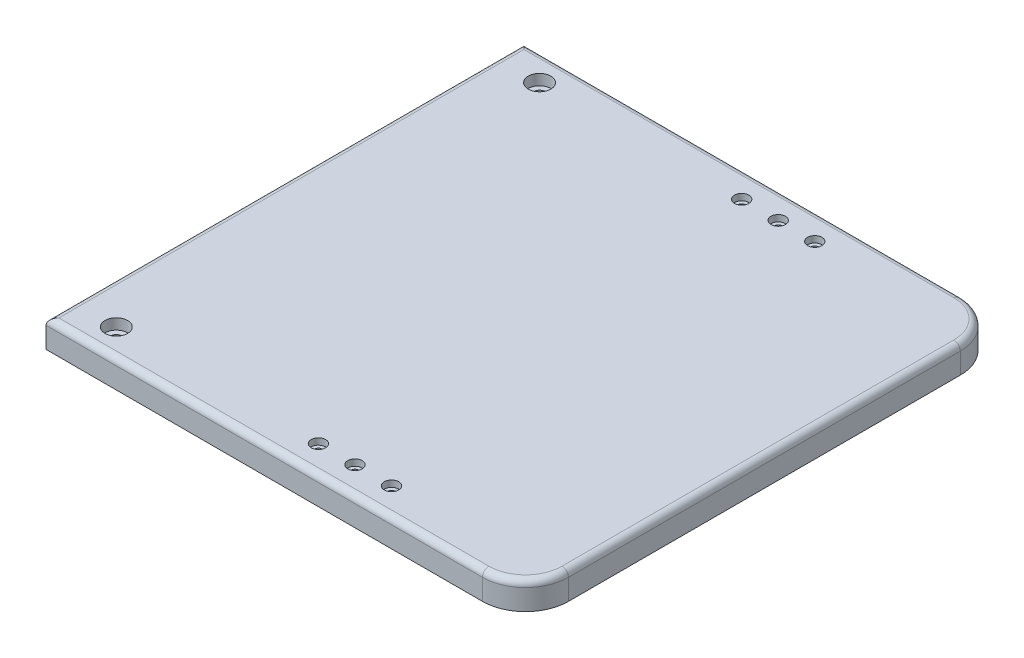
ISO-10303-21;
HEADER;
FILE_DESCRIPTION(('STEP AP214'),'2;1');
FILE_NAME('part.step','',(''),(''),'','','');
FILE_SCHEMA(('AUTOMOTIVE_DESIGN { 1 0 10303 214 1 1 1 1 }'));
ENDSEC;
DATA;
#1=APPLICATION_CONTEXT('core data for automotive mechanical design processes');
#2=APPLICATION_PROTOCOL_DEFINITION('international standard','automotive_design',2000,#1);
#3=PRODUCT_CONTEXT('',#1,'mechanical');
#4=PRODUCT('Part','Part','',(#3));
#5=PRODUCT_RELATED_PRODUCT_CATEGORY('part','',(#4));
#6=PRODUCT_DEFINITION_FORMATION('','',#4);
#7=PRODUCT_DEFINITION_CONTEXT('part definition',#1,'design');
#8=PRODUCT_DEFINITION('design','',#6,#7);
#9=PRODUCT_DEFINITION_SHAPE('','',#8);
#10=(LENGTH_UNIT() NAMED_UNIT(*) SI_UNIT(.MILLI.,.METRE.));
#11=(NAMED_UNIT(*) PLANE_ANGLE_UNIT() SI_UNIT($,.RADIAN.));
#12=(NAMED_UNIT(*) SI_UNIT($,.STERADIAN.) SOLID_ANGLE_UNIT());
#13=UNCERTAINTY_MEASURE_WITH_UNIT(LENGTH_MEASURE(1.E-05),#10,'distance_accuracy_value','');
#14=(GEOMETRIC_REPRESENTATION_CONTEXT(3) GLOBAL_UNCERTAINTY_ASSIGNED_CONTEXT((#13)) GLOBAL_UNIT_ASSIGNED_CONTEXT((#10,
#11,#12)) REPRESENTATION_CONTEXT('',''));
#15=CARTESIAN_POINT('',(0.,0.,0.));
#16=DIRECTION('',(0.,0.,1.));
#17=DIRECTION('',(1.,0.,0.));
#18=AXIS2_PLACEMENT_3D('',#15,#16,#17);
#19=CARTESIAN_POINT('',(-91.5,12.7,98.425));
#20=DIRECTION('',(0.,1.,0.));
#21=DIRECTION('',(0.,0.,1.));
#22=AXIS2_PLACEMENT_3D('',#19,#20,#21);
#23=CYLINDRICAL_SURFACE('',#22,2.75);
#24=CARTESIAN_POINT('',(-91.5,7.7,98.425));
#25=DIRECTION('',(0.,1.,0.));
#26=DIRECTION('',(0.,0.,1.));
#27=AXIS2_PLACEMENT_3D('',#24,#25,#26);
#28=CIRCLE('',#27,2.75);
#29=CARTESIAN_POINT('',(-91.5,7.7,101.175));
#30=VERTEX_POINT('',#29);
#31=EDGE_CURVE('E266',#30,#30,#28,.T.);
#32=ORIENTED_EDGE('',*,*,#31,.T.);
#33=EDGE_LOOP('',(#32));
#34=FACE_BOUND('',#33,.T.);
#35=CARTESIAN_POINT('',(-91.5,2.,98.425));
#36=DIRECTION('',(0.,-1.,0.));
#37=DIRECTION('',(0.,0.,-1.));
#38=AXIS2_PLACEMENT_3D('',#35,#36,#37);
#39=CIRCLE('',#38,2.75);
#40=CARTESIAN_POINT('',(-91.5,2.,95.675));
#41=VERTEX_POINT('',#40);
#42=EDGE_CURVE('E47',#41,#41,#39,.F.);
#43=ORIENTED_EDGE('',*,*,#42,.F.);
#44=EDGE_LOOP('',(#43));
#45=FACE_BOUND('',#44,.T.);
#46=ADVANCED_FACE('F43',(#34,#45),#23,.F.);
#47=CARTESIAN_POINT('',(111.5,12.7,-111.125));
#48=DIRECTION('',(-1.,0.,0.));
#49=DIRECTION('',(0.,0.,1.));
#50=AXIS2_PLACEMENT_3D('',#47,#48,#49);
#51=PLANE('',#50);
#52=DIRECTION('',(0.,-1.,0.));
#53=VECTOR('',#52,1.);
#54=CARTESIAN_POINT('',(111.5,12.7,-91.125));
#55=LINE('',#54,#53);
#56=CARTESIAN_POINT('',(111.5,0.,-91.125));
#57=VERTEX_POINT('',#56);
#58=CARTESIAN_POINT('',(111.5,9.7,-91.125));
#59=VERTEX_POINT('',#58);
#60=EDGE_CURVE('E159',#57,#59,#55,.F.);
#61=ORIENTED_EDGE('',*,*,#60,.T.);
#62=DIRECTION('',(0.,0.,-1.));
#63=VECTOR('',#62,1.);
#64=CARTESIAN_POINT('',(111.5,9.7,91.125));
#65=LINE('',#64,#63);
#66=CARTESIAN_POINT('',(111.5,9.7,91.125));
#67=VERTEX_POINT('',#66);
#68=EDGE_CURVE('E11',#59,#67,#65,.F.);
#69=ORIENTED_EDGE('',*,*,#68,.T.);
#70=DIRECTION('',(0.,-1.,0.));
#71=VECTOR('',#70,1.);
#72=CARTESIAN_POINT('',(111.5,12.7,91.125));
#73=LINE('',#72,#71);
#74=CARTESIAN_POINT('',(111.5,0.,91.125));
#75=VERTEX_POINT('',#74);
#76=EDGE_CURVE('E156',#67,#75,#73,.T.);
#77=ORIENTED_EDGE('',*,*,#76,.T.);
#78=DIRECTION('',(0.,0.,-1.));
#79=VECTOR('',#78,1.);
#80=CARTESIAN_POINT('',(111.5,0.,-111.125));
#81=LINE('',#80,#79);
#82=EDGE_CURVE('E135',#75,#57,#81,.T.);
#83=ORIENTED_EDGE('',*,*,#82,.T.);
#84=EDGE_LOOP('',(#61,#69,#77,#83));
#85=FACE_BOUND('',#84,.T.);
#86=ADVANCED_FACE('F368',(#85),#51,.F.);
#87=CARTESIAN_POINT('',(-111.5,12.7,-111.125));
#88=DIRECTION('',(0.,0.,1.));
#89=DIRECTION('',(1.,0.,0.));
#90=AXIS2_PLACEMENT_3D('',#87,#88,#89);
#91=PLANE('',#90);
#92=DIRECTION('',(0.,-1.,0.));
#93=VECTOR('',#92,1.);
#94=CARTESIAN_POINT('',(-111.5,12.7,-111.125));
#95=LINE('',#94,#93);
#96=CARTESIAN_POINT('',(-111.5,9.7,-111.125));
#97=VERTEX_POINT('',#96);
#98=CARTESIAN_POINT('',(-111.5,0.,-111.125));
#99=VERTEX_POINT('',#98);
#100=EDGE_CURVE('E116',#97,#99,#95,.T.);
#101=ORIENTED_EDGE('',*,*,#100,.F.);
#102=DIRECTION('',(-1.,0.,0.));
#103=VECTOR('',#102,1.);
#104=CARTESIAN_POINT('',(91.4999999999999,9.7,-111.125));
#105=LINE('',#104,#103);
#106=CARTESIAN_POINT('',(91.5,9.7,-111.125));
#107=VERTEX_POINT('',#106);
#108=EDGE_CURVE('E68',#97,#107,#105,.F.);
#109=ORIENTED_EDGE('',*,*,#108,.T.);
#110=DIRECTION('',(0.,-1.,0.));
#111=VECTOR('',#110,1.);
#112=CARTESIAN_POINT('',(91.5,12.7,-111.125));
#113=LINE('',#112,#111);
#114=CARTESIAN_POINT('',(91.4999999999999,0.,-111.125));
#115=VERTEX_POINT('',#114);
#116=EDGE_CURVE('E126',#107,#115,#113,.T.);
#117=ORIENTED_EDGE('',*,*,#116,.T.);
#118=DIRECTION('',(-1.,0.,0.));
#119=VECTOR('',#118,1.);
#120=CARTESIAN_POINT('',(-111.5,0.,-111.125));
#121=LINE('',#120,#119);
#122=EDGE_CURVE('E130',#115,#99,#121,.T.);
#123=ORIENTED_EDGE('',*,*,#122,.T.);
#124=EDGE_LOOP('',(#101,#109,#117,#123));
#125=FACE_BOUND('',#124,.T.);
#126=ADVANCED_FACE('F131',(#125),#91,.F.);
#127=CARTESIAN_POINT('',(-111.5,12.7,-111.125));
#128=DIRECTION('',(1.,0.,0.));
#129=DIRECTION('',(0.,0.,-1.));
#130=AXIS2_PLACEMENT_3D('',#127,#128,#129);
#131=PLANE('',#130);
#132=DIRECTION('',(0.,-1.,0.));
#133=VECTOR('',#132,1.);
#134=CARTESIAN_POINT('',(-111.5,12.7,111.125));
#135=LINE('',#134,#133);
#136=CARTESIAN_POINT('',(-111.5,9.7,111.125));
#137=VERTEX_POINT('',#136);
#138=CARTESIAN_POINT('',(-111.5,0.,111.125));
#139=VERTEX_POINT('',#138);
#140=EDGE_CURVE('E127',#137,#139,#135,.T.);
#141=ORIENTED_EDGE('',*,*,#140,.F.);
#142=DIRECTION('',(0.,0.,1.));
#143=VECTOR('',#142,1.);
#144=CARTESIAN_POINT('',(-111.5,9.7,-111.125));
#145=LINE('',#144,#143);
#146=EDGE_CURVE('E124',#137,#97,#145,.F.);
#147=ORIENTED_EDGE('',*,*,#146,.T.);
#148=ORIENTED_EDGE('',*,*,#100,.T.);
#149=DIRECTION('',(0.,0.,1.));
#150=VECTOR('',#149,1.);
#151=CARTESIAN_POINT('',(-111.5,0.,-111.125));
#152=LINE('',#151,#150);
#153=EDGE_CURVE('E121',#99,#139,#152,.T.);
#154=ORIENTED_EDGE('',*,*,#153,.T.);
#155=EDGE_LOOP('',(#141,#147,#148,#154));
#156=FACE_BOUND('',#155,.T.);
#157=ADVANCED_FACE('F119',(#156),#131,.F.);
#158=CARTESIAN_POINT('',(-111.5,12.7,111.125));
#159=DIRECTION('',(0.,0.,-1.));
#160=DIRECTION('',(-1.,0.,0.));
#161=AXIS2_PLACEMENT_3D('',#158,#159,#160);
#162=PLANE('',#161);
#163=DIRECTION('',(0.,-1.,0.));
#164=VECTOR('',#163,1.);
#165=CARTESIAN_POINT('',(91.5,12.7,111.125));
#166=LINE('',#165,#164);
#167=CARTESIAN_POINT('',(91.5,0.,111.125));
#168=VERTEX_POINT('',#167);
#169=CARTESIAN_POINT('',(91.5,9.7,111.125));
#170=VERTEX_POINT('',#169);
#171=EDGE_CURVE('E162',#168,#170,#166,.F.);
#172=ORIENTED_EDGE('',*,*,#171,.T.);
#173=DIRECTION('',(1.,0.,0.));
#174=VECTOR('',#173,1.);
#175=CARTESIAN_POINT('',(-111.5,9.7,111.125));
#176=LINE('',#175,#174);
#177=EDGE_CURVE('E189',#170,#137,#176,.F.);
#178=ORIENTED_EDGE('',*,*,#177,.T.);
#179=ORIENTED_EDGE('',*,*,#140,.T.);
#180=DIRECTION('',(1.,0.,0.));
#181=VECTOR('',#180,1.);
#182=CARTESIAN_POINT('',(-111.5,0.,111.125));
#183=LINE('',#182,#181);
#184=EDGE_CURVE('E139',#139,#168,#183,.T.);
#185=ORIENTED_EDGE('',*,*,#184,.T.);
#186=EDGE_LOOP('',(#172,#178,#179,#185));
#187=FACE_BOUND('',#186,.T.);
#188=ADVANCED_FACE('F399',(#187),#162,.F.);
#189=CARTESIAN_POINT('',(0.,12.7,0.));
#190=DIRECTION('',(0.,1.,0.));
#191=DIRECTION('',(0.,0.,1.));
#192=AXIS2_PLACEMENT_3D('',#189,#190,#191);
#193=PLANE('',#192);
#194=CARTESIAN_POINT('',(-91.5,12.7,-98.425));
#195=DIRECTION('',(0.,1.,0.));
#196=DIRECTION('',(0.,0.,1.));
#197=AXIS2_PLACEMENT_3D('',#194,#195,#196);
#198=CIRCLE('',#197,5.25);
#199=CARTESIAN_POINT('',(-91.5,12.7,-93.175));
#200=VERTEX_POINT('',#199);
#201=EDGE_CURVE('E229',#200,#200,#198,.T.);
#202=ORIENTED_EDGE('',*,*,#201,.F.);
#203=EDGE_LOOP('',(#202));
#204=FACE_BOUND('',#203,.T.);
#205=CARTESIAN_POINT('',(-91.5,12.7,98.425));
#206=DIRECTION('',(0.,1.,0.));
#207=DIRECTION('',(0.,0.,1.));
#208=AXIS2_PLACEMENT_3D('',#205,#206,#207);
#209=CIRCLE('',#208,5.25);
#210=CARTESIAN_POINT('',(-91.5,12.7,103.675));
#211=VERTEX_POINT('',#210);
#212=EDGE_CURVE('E258',#211,#211,#209,.T.);
#213=ORIENTED_EDGE('',*,*,#212,.F.);
#214=EDGE_LOOP('',(#213));
#215=FACE_BOUND('',#214,.T.);
#216=CARTESIAN_POINT('',(36.5,12.7,98.425));
#217=DIRECTION('',(0.,1.,0.));
#218=DIRECTION('',(0.,0.,1.));
#219=AXIS2_PLACEMENT_3D('',#216,#217,#218);
#220=CIRCLE('',#219,3.35);
#221=CARTESIAN_POINT('',(36.5,12.7,101.775));
#222=VERTEX_POINT('',#221);
#223=EDGE_CURVE('E270',#222,#222,#220,.T.);
#224=ORIENTED_EDGE('',*,*,#223,.F.);
#225=EDGE_LOOP('',(#224));
#226=FACE_BOUND('',#225,.T.);
#227=CARTESIAN_POINT('',(36.5,12.7,-98.425));
#228=DIRECTION('',(0.,1.,0.));
#229=DIRECTION('',(0.,0.,1.));
#230=AXIS2_PLACEMENT_3D('',#227,#228,#229);
#231=CIRCLE('',#230,3.35);
#232=CARTESIAN_POINT('',(36.5,12.7,-95.075));
#233=VERTEX_POINT('',#232);
#234=EDGE_CURVE('E286',#233,#233,#231,.T.);
#235=ORIENTED_EDGE('',*,*,#234,.F.);
#236=EDGE_LOOP('',(#235));
#237=FACE_BOUND('',#236,.T.);
#238=CARTESIAN_POINT('',(19.5,12.7,98.425));
#239=DIRECTION('',(0.,1.,0.));
#240=DIRECTION('',(0.,0.,1.));
#241=AXIS2_PLACEMENT_3D('',#238,#239,#240);
#242=CIRCLE('',#241,3.35);
#243=CARTESIAN_POINT('',(19.5,12.7,101.775));
#244=VERTEX_POINT('',#243);
#245=EDGE_CURVE('E302',#244,#244,#242,.T.);
#246=ORIENTED_EDGE('',*,*,#245,.F.);
#247=EDGE_LOOP('',(#246));
#248=FACE_BOUND('',#247,.T.);
#249=CARTESIAN_POINT('',(19.5,12.7,-98.425));
#250=DIRECTION('',(0.,1.,0.));
#251=DIRECTION('',(0.,0.,1.));
#252=AXIS2_PLACEMENT_3D('',#249,#250,#251);
#253=CIRCLE('',#252,3.35);
#254=CARTESIAN_POINT('',(19.5,12.7,-95.075));
#255=VERTEX_POINT('',#254);
#256=EDGE_CURVE('E318',#255,#255,#253,.T.);
#257=ORIENTED_EDGE('',*,*,#256,.F.);
#258=EDGE_LOOP('',(#257));
#259=FACE_BOUND('',#258,.T.);
#260=CARTESIAN_POINT('',(2.49999999999999,12.7,98.425));
#261=DIRECTION('',(0.,1.,0.));
#262=DIRECTION('',(0.,0.,1.));
#263=AXIS2_PLACEMENT_3D('',#260,#261,#262);
#264=CIRCLE('',#263,3.35);
#265=CARTESIAN_POINT('',(2.49999999999999,12.7,101.775));
#266=VERTEX_POINT('',#265);
#267=EDGE_CURVE('E334',#266,#266,#264,.T.);
#268=ORIENTED_EDGE('',*,*,#267,.F.);
#269=EDGE_LOOP('',(#268));
#270=FACE_BOUND('',#269,.T.);
#271=CARTESIAN_POINT('',(2.49999999999996,12.7,-98.425));
#272=DIRECTION('',(0.,1.,0.));
#273=DIRECTION('',(0.,0.,1.));
#274=AXIS2_PLACEMENT_3D('',#271,#272,#273);
#275=CIRCLE('',#274,3.35);
#276=CARTESIAN_POINT('',(2.49999999999996,12.7,-95.075));
#277=VERTEX_POINT('',#276);
#278=EDGE_CURVE('E350',#277,#277,#275,.T.);
#279=ORIENTED_EDGE('',*,*,#278,.F.);
#280=EDGE_LOOP('',(#279));
#281=FACE_BOUND('',#280,.T.);
#282=DIRECTION('',(1.,0.,0.));
#283=VECTOR('',#282,1.);
#284=CARTESIAN_POINT('',(91.5,12.7,108.125));
#285=LINE('',#284,#283);
#286=CARTESIAN_POINT('',(-108.5,12.7,108.125));
#287=VERTEX_POINT('',#286);
#288=CARTESIAN_POINT('',(91.5,12.7,108.125));
#289=VERTEX_POINT('',#288);
#290=EDGE_CURVE('E178',#287,#289,#285,.T.);
#291=ORIENTED_EDGE('',*,*,#290,.T.);
#292=CARTESIAN_POINT('',(91.5,12.7,91.125));
#293=DIRECTION('',(0.,1.,0.));
#294=DIRECTION('',(0.,0.,1.));
#295=AXIS2_PLACEMENT_3D('',#292,#293,#294);
#296=CIRCLE('',#295,17.);
#297=CARTESIAN_POINT('',(108.5,12.7,91.125));
#298=VERTEX_POINT('',#297);
#299=EDGE_CURVE('E181',#289,#298,#296,.T.);
#300=ORIENTED_EDGE('',*,*,#299,.T.);
#301=DIRECTION('',(0.,0.,-1.));
#302=VECTOR('',#301,1.);
#303=CARTESIAN_POINT('',(108.5,12.7,-91.125));
#304=LINE('',#303,#302);
#305=CARTESIAN_POINT('',(108.5,12.7,-91.125));
#306=VERTEX_POINT('',#305);
#307=EDGE_CURVE('E166',#298,#306,#304,.T.);
#308=ORIENTED_EDGE('',*,*,#307,.T.);
#309=CARTESIAN_POINT('',(91.5,12.7,-91.125));
#310=DIRECTION('',(0.,1.,0.));
#311=DIRECTION('',(0.,0.,1.));
#312=AXIS2_PLACEMENT_3D('',#309,#310,#311);
#313=CIRCLE('',#312,17.);
#314=CARTESIAN_POINT('',(91.5,12.7,-108.125));
#315=VERTEX_POINT('',#314);
#316=EDGE_CURVE('E169',#306,#315,#313,.T.);
#317=ORIENTED_EDGE('',*,*,#316,.T.);
#318=DIRECTION('',(-1.,0.,0.));
#319=VECTOR('',#318,1.);
#320=CARTESIAN_POINT('',(-111.5,12.7,-108.125));
#321=LINE('',#320,#319);
#322=CARTESIAN_POINT('',(-108.5,12.7,-108.125));
#323=VERTEX_POINT('',#322);
#324=EDGE_CURVE('E172',#315,#323,#321,.T.);
#325=ORIENTED_EDGE('',*,*,#324,.T.);
#326=DIRECTION('',(0.,0.,1.));
#327=VECTOR('',#326,1.);
#328=CARTESIAN_POINT('',(-108.5,12.7,111.125));
#329=LINE('',#328,#327);
#330=EDGE_CURVE('E175',#323,#287,#329,.T.);
#331=ORIENTED_EDGE('',*,*,#330,.T.);
#332=EDGE_LOOP('',(#291,#300,#308,#317,#325,#331));
#333=FACE_BOUND('',#332,.T.);
#334=ADVANCED_FACE('F404',(#204,#215,#226,#237,#248,#259,#270,#281,#333),#193,.T.);
#335=CARTESIAN_POINT('',(0.,0.,0.));
#336=DIRECTION('',(0.,1.,0.));
#337=DIRECTION('',(0.,0.,1.));
#338=AXIS2_PLACEMENT_3D('',#335,#336,#337);
#339=PLANE('',#338);
#340=CARTESIAN_POINT('',(-91.5,0.,98.425));
#341=DIRECTION('',(0.,-1.,0.));
#342=DIRECTION('',(0.,0.,-1.));
#343=AXIS2_PLACEMENT_3D('',#340,#341,#342);
#344=CIRCLE('',#343,6.5);
#345=CARTESIAN_POINT('',(-91.5,0.,91.925));
#346=VERTEX_POINT('',#345);
#347=EDGE_CURVE('E231',#346,#346,#344,.T.);
#348=ORIENTED_EDGE('',*,*,#347,.F.);
#349=EDGE_LOOP('',(#348));
#350=FACE_BOUND('',#349,.T.);
#351=CARTESIAN_POINT('',(-91.4999999999999,0.,-98.4250000000001));
#352=DIRECTION('',(0.,-1.,0.));
#353=DIRECTION('',(0.,0.,1.));
#354=AXIS2_PLACEMENT_3D('',#351,#352,#353);
#355=CIRCLE('',#354,6.5);
#356=CARTESIAN_POINT('',(-91.4999999999999,0.,-91.9250000000001));
#357=VERTEX_POINT('',#356);
#358=EDGE_CURVE('E237',#357,#357,#355,.T.);
#359=ORIENTED_EDGE('',*,*,#358,.F.);
#360=EDGE_LOOP('',(#359));
#361=FACE_BOUND('',#360,.T.);
#362=CARTESIAN_POINT('',(36.5,0.,98.425));
#363=DIRECTION('',(0.,1.,0.));
#364=DIRECTION('',(0.,0.,1.));
#365=AXIS2_PLACEMENT_3D('',#362,#363,#364);
#366=CIRCLE('',#365,1.7);
#367=CARTESIAN_POINT('',(36.5,0.,100.125));
#368=VERTEX_POINT('',#367);
#369=EDGE_CURVE('E282',#368,#368,#366,.T.);
#370=ORIENTED_EDGE('',*,*,#369,.T.);
#371=EDGE_LOOP('',(#370));
#372=FACE_BOUND('',#371,.T.);
#373=CARTESIAN_POINT('',(36.5,0.,-98.425));
#374=DIRECTION('',(0.,1.,0.));
#375=DIRECTION('',(0.,0.,1.));
#376=AXIS2_PLACEMENT_3D('',#373,#374,#375);
#377=CIRCLE('',#376,1.7);
#378=CARTESIAN_POINT('',(36.5,0.,-96.725));
#379=VERTEX_POINT('',#378);
#380=EDGE_CURVE('E298',#379,#379,#377,.T.);
#381=ORIENTED_EDGE('',*,*,#380,.T.);
#382=EDGE_LOOP('',(#381));
#383=FACE_BOUND('',#382,.T.);
#384=CARTESIAN_POINT('',(19.5,0.,98.425));
#385=DIRECTION('',(0.,1.,0.));
#386=DIRECTION('',(0.,0.,1.));
#387=AXIS2_PLACEMENT_3D('',#384,#385,#386);
#388=CIRCLE('',#387,1.7);
#389=CARTESIAN_POINT('',(19.5,0.,100.125));
#390=VERTEX_POINT('',#389);
#391=EDGE_CURVE('E314',#390,#390,#388,.T.);
#392=ORIENTED_EDGE('',*,*,#391,.T.);
#393=EDGE_LOOP('',(#392));
#394=FACE_BOUND('',#393,.T.);
#395=CARTESIAN_POINT('',(19.5,0.,-98.425));
#396=DIRECTION('',(0.,1.,0.));
#397=DIRECTION('',(0.,0.,1.));
#398=AXIS2_PLACEMENT_3D('',#395,#396,#397);
#399=CIRCLE('',#398,1.7);
#400=CARTESIAN_POINT('',(19.5,0.,-96.725));
#401=VERTEX_POINT('',#400);
#402=EDGE_CURVE('E330',#401,#401,#399,.T.);
#403=ORIENTED_EDGE('',*,*,#402,.T.);
#404=EDGE_LOOP('',(#403));
#405=FACE_BOUND('',#404,.T.);
#406=CARTESIAN_POINT('',(2.49999999999999,0.,98.425));
#407=DIRECTION('',(0.,1.,0.));
#408=DIRECTION('',(0.,0.,1.));
#409=AXIS2_PLACEMENT_3D('',#406,#407,#408);
#410=CIRCLE('',#409,1.7);
#411=CARTESIAN_POINT('',(2.49999999999999,0.,100.125));
#412=VERTEX_POINT('',#411);
#413=EDGE_CURVE('E346',#412,#412,#410,.T.);
#414=ORIENTED_EDGE('',*,*,#413,.T.);
#415=EDGE_LOOP('',(#414));
#416=FACE_BOUND('',#415,.T.);
#417=CARTESIAN_POINT('',(2.49999999999996,0.,-98.425));
#418=DIRECTION('',(0.,1.,0.));
#419=DIRECTION('',(0.,0.,1.));
#420=AXIS2_PLACEMENT_3D('',#417,#418,#419);
#421=CIRCLE('',#420,1.7);
#422=CARTESIAN_POINT('',(2.49999999999996,0.,-96.725));
#423=VERTEX_POINT('',#422);
#424=EDGE_CURVE('E202',#423,#423,#421,.T.);
#425=ORIENTED_EDGE('',*,*,#424,.T.);
#426=EDGE_LOOP('',(#425));
#427=FACE_BOUND('',#426,.T.);
#428=ORIENTED_EDGE('',*,*,#122,.F.);
#429=CARTESIAN_POINT('',(91.5,0.,-91.125));
#430=DIRECTION('',(0.,1.,0.));
#431=DIRECTION('',(0.,0.,1.));
#432=AXIS2_PLACEMENT_3D('',#429,#430,#431);
#433=CIRCLE('',#432,20.);
#434=EDGE_CURVE('E153',#115,#57,#433,.F.);
#435=ORIENTED_EDGE('',*,*,#434,.T.);
#436=ORIENTED_EDGE('',*,*,#82,.F.);
#437=CARTESIAN_POINT('',(91.5,0.,91.125));
#438=DIRECTION('',(0.,1.,0.));
#439=DIRECTION('',(0.,0.,1.));
#440=AXIS2_PLACEMENT_3D('',#437,#438,#439);
#441=CIRCLE('',#440,20.);
#442=EDGE_CURVE('E150',#75,#168,#441,.F.);
#443=ORIENTED_EDGE('',*,*,#442,.T.);
#444=ORIENTED_EDGE('',*,*,#184,.F.);
#445=ORIENTED_EDGE('',*,*,#153,.F.);
#446=EDGE_LOOP('',(#428,#435,#436,#443,#444,#445));
#447=FACE_BOUND('',#446,.T.);
#448=ADVANCED_FACE('F137',(#350,#361,#372,#383,#394,#405,#416,#427,#447),#339,.F.);
#449=CARTESIAN_POINT('',(91.5,12.7,-91.125));
#450=DIRECTION('',(0.,-1.,0.));
#451=DIRECTION('',(0.,0.,-1.));
#452=AXIS2_PLACEMENT_3D('',#449,#450,#451);
#453=CYLINDRICAL_SURFACE('',#452,20.);
#454=ORIENTED_EDGE('',*,*,#116,.F.);
#455=CARTESIAN_POINT('',(91.5,9.7,-91.125));
#456=DIRECTION('',(0.,1.,0.));
#457=DIRECTION('',(0.,0.,1.));
#458=AXIS2_PLACEMENT_3D('',#455,#456,#457);
#459=CIRCLE('',#458,20.);
#460=EDGE_CURVE('E53',#107,#59,#459,.F.);
#461=ORIENTED_EDGE('',*,*,#460,.T.);
#462=ORIENTED_EDGE('',*,*,#60,.F.);
#463=ORIENTED_EDGE('',*,*,#434,.F.);
#464=EDGE_LOOP('',(#454,#461,#462,#463));
#465=FACE_BOUND('',#464,.T.);
#466=ADVANCED_FACE('F372',(#465),#453,.T.);
#467=CARTESIAN_POINT('',(91.5,12.7,91.125));
#468=DIRECTION('',(0.,-1.,0.));
#469=DIRECTION('',(0.,0.,-1.));
#470=AXIS2_PLACEMENT_3D('',#467,#468,#469);
#471=CYLINDRICAL_SURFACE('',#470,20.);
#472=ORIENTED_EDGE('',*,*,#76,.F.);
#473=CARTESIAN_POINT('',(91.5,9.7,91.125));
#474=DIRECTION('',(0.,1.,0.));
#475=DIRECTION('',(0.,0.,1.));
#476=AXIS2_PLACEMENT_3D('',#473,#474,#475);
#477=CIRCLE('',#476,20.);
#478=EDGE_CURVE('E185',#67,#170,#477,.F.);
#479=ORIENTED_EDGE('',*,*,#478,.T.);
#480=ORIENTED_EDGE('',*,*,#171,.F.);
#481=ORIENTED_EDGE('',*,*,#442,.F.);
#482=EDGE_LOOP('',(#472,#479,#480,#481));
#483=FACE_BOUND('',#482,.T.);
#484=ADVANCED_FACE('F387',(#483),#471,.T.);
#485=CARTESIAN_POINT('',(0.,9.7,-108.125));
#486=DIRECTION('',(1.,0.,0.));
#487=DIRECTION('',(0.,0.,-1.));
#488=AXIS2_PLACEMENT_3D('',#485,#486,#487);
#489=CYLINDRICAL_SURFACE('',#488,3.);
#490=CARTESIAN_POINT('',(91.5,9.7,-108.125));
#491=DIRECTION('',(1.,0.,0.));
#492=DIRECTION('',(0.,0.,-1.));
#493=AXIS2_PLACEMENT_3D('',#490,#491,#492);
#494=CIRCLE('',#493,3.);
#495=EDGE_CURVE('E213',#107,#315,#494,.T.);
#496=ORIENTED_EDGE('',*,*,#495,.F.);
#497=ORIENTED_EDGE('',*,*,#108,.F.);
#498=CARTESIAN_POINT('',(-108.5,9.7,-108.125));
#499=DIRECTION('',(0.707106781186547,0.,-0.707106781186548));
#500=DIRECTION('',(0.707106781186548,0.,0.707106781186547));
#501=AXIS2_PLACEMENT_3D('',#498,#499,#500);
#502=ELLIPSE('',#501,4.24264068711929,3.);
#503=EDGE_CURVE('E217',#323,#97,#502,.F.);
#504=ORIENTED_EDGE('',*,*,#503,.F.);
#505=ORIENTED_EDGE('',*,*,#324,.F.);
#506=EDGE_LOOP('',(#496,#497,#504,#505));
#507=FACE_BOUND('',#506,.T.);
#508=ADVANCED_FACE('F45',(#507),#489,.T.);
#509=CARTESIAN_POINT('',(-108.5,9.7,0.));
#510=DIRECTION('',(0.,0.,-1.));
#511=DIRECTION('',(-1.,0.,0.));
#512=AXIS2_PLACEMENT_3D('',#509,#510,#511);
#513=CYLINDRICAL_SURFACE('',#512,3.);
#514=ORIENTED_EDGE('',*,*,#503,.T.);
#515=ORIENTED_EDGE('',*,*,#146,.F.);
#516=CARTESIAN_POINT('',(-108.5,9.7,108.125));
#517=DIRECTION('',(-0.707106781186548,0.,-0.707106781186547));
#518=DIRECTION('',(0.707106781186547,0.,-0.707106781186548));
#519=AXIS2_PLACEMENT_3D('',#516,#517,#518);
#520=ELLIPSE('',#519,4.24264068711928,3.);
#521=EDGE_CURVE('E209',#287,#137,#520,.F.);
#522=ORIENTED_EDGE('',*,*,#521,.F.);
#523=ORIENTED_EDGE('',*,*,#330,.F.);
#524=EDGE_LOOP('',(#514,#515,#522,#523));
#525=FACE_BOUND('',#524,.T.);
#526=ADVANCED_FACE('F401',(#525),#513,.T.);
#527=CARTESIAN_POINT('',(91.5,9.7,-91.125));
#528=DIRECTION('',(0.,1.,0.));
#529=DIRECTION('',(0.,0.,1.));
#530=AXIS2_PLACEMENT_3D('',#527,#528,#529);
#531=TOROIDAL_SURFACE('',#530,17.,3.);
#532=ORIENTED_EDGE('',*,*,#495,.T.);
#533=ORIENTED_EDGE('',*,*,#316,.F.);
#534=CARTESIAN_POINT('',(108.5,9.7,-91.125));
#535=DIRECTION('',(0.,0.,1.));
#536=DIRECTION('',(1.,0.,0.));
#537=AXIS2_PLACEMENT_3D('',#534,#535,#536);
#538=CIRCLE('',#537,3.);
#539=EDGE_CURVE('E205',#59,#306,#538,.T.);
#540=ORIENTED_EDGE('',*,*,#539,.F.);
#541=ORIENTED_EDGE('',*,*,#460,.F.);
#542=EDGE_LOOP('',(#532,#533,#540,#541));
#543=FACE_BOUND('',#542,.T.);
#544=ADVANCED_FACE('F379',(#543),#531,.T.);
#545=CARTESIAN_POINT('',(0.,9.7,108.125));
#546=DIRECTION('',(-1.,0.,0.));
#547=DIRECTION('',(0.,0.,1.));
#548=AXIS2_PLACEMENT_3D('',#545,#546,#547);
#549=CYLINDRICAL_SURFACE('',#548,3.);
#550=ORIENTED_EDGE('',*,*,#521,.T.);
#551=ORIENTED_EDGE('',*,*,#177,.F.);
#552=CARTESIAN_POINT('',(91.5,9.7,108.125));
#553=DIRECTION('',(1.,0.,0.));
#554=DIRECTION('',(0.,0.,-1.));
#555=AXIS2_PLACEMENT_3D('',#552,#553,#554);
#556=CIRCLE('',#555,3.);
#557=EDGE_CURVE('E201',#289,#170,#556,.T.);
#558=ORIENTED_EDGE('',*,*,#557,.F.);
#559=ORIENTED_EDGE('',*,*,#290,.F.);
#560=EDGE_LOOP('',(#550,#551,#558,#559));
#561=FACE_BOUND('',#560,.T.);
#562=ADVANCED_FACE('F396',(#561),#549,.T.);
#563=CARTESIAN_POINT('',(108.5,9.7,0.));
#564=DIRECTION('',(0.,0.,1.));
#565=DIRECTION('',(1.,0.,0.));
#566=AXIS2_PLACEMENT_3D('',#563,#564,#565);
#567=CYLINDRICAL_SURFACE('',#566,3.);
#568=ORIENTED_EDGE('',*,*,#539,.T.);
#569=ORIENTED_EDGE('',*,*,#307,.F.);
#570=CARTESIAN_POINT('',(108.5,9.7,91.125));
#571=DIRECTION('',(0.,0.,1.));
#572=DIRECTION('',(1.,0.,0.));
#573=AXIS2_PLACEMENT_3D('',#570,#571,#572);
#574=CIRCLE('',#573,3.);
#575=EDGE_CURVE('E198',#67,#298,#574,.T.);
#576=ORIENTED_EDGE('',*,*,#575,.F.);
#577=ORIENTED_EDGE('',*,*,#68,.F.);
#578=EDGE_LOOP('',(#568,#569,#576,#577));
#579=FACE_BOUND('',#578,.T.);
#580=ADVANCED_FACE('F384',(#579),#567,.T.);
#581=CARTESIAN_POINT('',(91.5,9.7,91.125));
#582=DIRECTION('',(0.,1.,0.));
#583=DIRECTION('',(0.,0.,1.));
#584=AXIS2_PLACEMENT_3D('',#581,#582,#583);
#585=TOROIDAL_SURFACE('',#584,17.,3.);
#586=ORIENTED_EDGE('',*,*,#557,.T.);
#587=ORIENTED_EDGE('',*,*,#478,.F.);
#588=ORIENTED_EDGE('',*,*,#575,.T.);
#589=ORIENTED_EDGE('',*,*,#299,.F.);
#590=EDGE_LOOP('',(#586,#587,#588,#589));
#591=FACE_BOUND('',#590,.T.);
#592=ADVANCED_FACE('F390',(#591),#585,.T.);
#593=CARTESIAN_POINT('',(2.49999999999996,12.7,-98.425));
#594=DIRECTION('',(0.,1.,0.));
#595=DIRECTION('',(0.,0.,1.));
#596=AXIS2_PLACEMENT_3D('',#593,#594,#595);
#597=CYLINDRICAL_SURFACE('',#596,1.7);
#598=ORIENTED_EDGE('',*,*,#424,.F.);
#599=EDGE_LOOP('',(#598));
#600=FACE_BOUND('',#599,.T.);
#601=CARTESIAN_POINT('',(2.49999999999996,9.7,-98.425));
#602=DIRECTION('',(0.,1.,0.));
#603=DIRECTION('',(0.,0.,1.));
#604=AXIS2_PLACEMENT_3D('',#601,#602,#603);
#605=CIRCLE('',#604,1.7);
#606=CARTESIAN_POINT('',(2.49999999999996,9.7,-96.725));
#607=VERTEX_POINT('',#606);
#608=EDGE_CURVE('E358',#607,#607,#605,.T.);
#609=ORIENTED_EDGE('',*,*,#608,.T.);
#610=EDGE_LOOP('',(#609));
#611=FACE_BOUND('',#610,.T.);
#612=ADVANCED_FACE('F496',(#600,#611),#597,.F.);
#613=CARTESIAN_POINT('',(4.19999999999996,9.7,-98.425));
#614=DIRECTION('',(0.,-1.,0.));
#615=DIRECTION('',(0.,0.,-1.));
#616=AXIS2_PLACEMENT_3D('',#613,#614,#615);
#617=PLANE('',#616);
#618=ORIENTED_EDGE('',*,*,#608,.F.);
#619=EDGE_LOOP('',(#618));
#620=FACE_BOUND('',#619,.T.);
#621=CARTESIAN_POINT('',(2.49999999999996,9.7,-98.425));
#622=DIRECTION('',(0.,1.,0.));
#623=DIRECTION('',(0.,0.,1.));
#624=AXIS2_PLACEMENT_3D('',#621,#622,#623);
#625=CIRCLE('',#624,3.35);
#626=CARTESIAN_POINT('',(2.49999999999996,9.7,-95.075));
#627=VERTEX_POINT('',#626);
#628=EDGE_CURVE('E354',#627,#627,#625,.T.);
#629=ORIENTED_EDGE('',*,*,#628,.T.);
#630=EDGE_LOOP('',(#629));
#631=FACE_BOUND('',#630,.T.);
#632=ADVANCED_FACE('F493',(#620,#631),#617,.F.);
#633=CARTESIAN_POINT('',(2.49999999999996,12.7,-98.425));
#634=DIRECTION('',(0.,1.,0.));
#635=DIRECTION('',(0.,0.,1.));
#636=AXIS2_PLACEMENT_3D('',#633,#634,#635);
#637=CYLINDRICAL_SURFACE('',#636,3.35);
#638=ORIENTED_EDGE('',*,*,#628,.F.);
#639=EDGE_LOOP('',(#638));
#640=FACE_BOUND('',#639,.T.);
#641=ORIENTED_EDGE('',*,*,#278,.T.);
#642=EDGE_LOOP('',(#641));
#643=FACE_BOUND('',#642,.T.);
#644=ADVANCED_FACE('F489',(#640,#643),#637,.F.);
#645=CARTESIAN_POINT('',(2.49999999999999,12.7,98.425));
#646=DIRECTION('',(0.,1.,0.));
#647=DIRECTION('',(0.,0.,1.));
#648=AXIS2_PLACEMENT_3D('',#645,#646,#647);
#649=CYLINDRICAL_SURFACE('',#648,1.7);
#650=ORIENTED_EDGE('',*,*,#413,.F.);
#651=EDGE_LOOP('',(#650));
#652=FACE_BOUND('',#651,.T.);
#653=CARTESIAN_POINT('',(2.49999999999999,9.7,98.425));
#654=DIRECTION('',(0.,1.,0.));
#655=DIRECTION('',(0.,0.,1.));
#656=AXIS2_PLACEMENT_3D('',#653,#654,#655);
#657=CIRCLE('',#656,1.7);
#658=CARTESIAN_POINT('',(2.49999999999999,9.7,100.125));
#659=VERTEX_POINT('',#658);
#660=EDGE_CURVE('E342',#659,#659,#657,.T.);
#661=ORIENTED_EDGE('',*,*,#660,.T.);
#662=EDGE_LOOP('',(#661));
#663=FACE_BOUND('',#662,.T.);
#664=ADVANCED_FACE('F485',(#652,#663),#649,.F.);
#665=CARTESIAN_POINT('',(4.19999999999999,9.7,98.425));
#666=DIRECTION('',(0.,-1.,0.));
#667=DIRECTION('',(0.,0.,-1.));
#668=AXIS2_PLACEMENT_3D('',#665,#666,#667);
#669=PLANE('',#668);
#670=ORIENTED_EDGE('',*,*,#660,.F.);
#671=EDGE_LOOP('',(#670));
#672=FACE_BOUND('',#671,.T.);
#673=CARTESIAN_POINT('',(2.49999999999999,9.7,98.425));
#674=DIRECTION('',(0.,1.,0.));
#675=DIRECTION('',(0.,0.,1.));
#676=AXIS2_PLACEMENT_3D('',#673,#674,#675);
#677=CIRCLE('',#676,3.35);
#678=CARTESIAN_POINT('',(2.49999999999999,9.7,101.775));
#679=VERTEX_POINT('',#678);
#680=EDGE_CURVE('E338',#679,#679,#677,.T.);
#681=ORIENTED_EDGE('',*,*,#680,.T.);
#682=EDGE_LOOP('',(#681));
#683=FACE_BOUND('',#682,.T.);
#684=ADVANCED_FACE('F481',(#672,#683),#669,.F.);
#685=CARTESIAN_POINT('',(2.49999999999999,12.7,98.425));
#686=DIRECTION('',(0.,1.,0.));
#687=DIRECTION('',(0.,0.,1.));
#688=AXIS2_PLACEMENT_3D('',#685,#686,#687);
#689=CYLINDRICAL_SURFACE('',#688,3.35);
#690=ORIENTED_EDGE('',*,*,#680,.F.);
#691=EDGE_LOOP('',(#690));
#692=FACE_BOUND('',#691,.T.);
#693=ORIENTED_EDGE('',*,*,#267,.T.);
#694=EDGE_LOOP('',(#693));
#695=FACE_BOUND('',#694,.T.);
#696=ADVANCED_FACE('F477',(#692,#695),#689,.F.);
#697=CARTESIAN_POINT('',(19.5,12.7,-98.425));
#698=DIRECTION('',(0.,1.,0.));
#699=DIRECTION('',(0.,0.,1.));
#700=AXIS2_PLACEMENT_3D('',#697,#698,#699);
#701=CYLINDRICAL_SURFACE('',#700,1.7);
#702=ORIENTED_EDGE('',*,*,#402,.F.);
#703=EDGE_LOOP('',(#702));
#704=FACE_BOUND('',#703,.T.);
#705=CARTESIAN_POINT('',(19.5,9.7,-98.425));
#706=DIRECTION('',(0.,1.,0.));
#707=DIRECTION('',(0.,0.,1.));
#708=AXIS2_PLACEMENT_3D('',#705,#706,#707);
#709=CIRCLE('',#708,1.7);
#710=CARTESIAN_POINT('',(19.5,9.7,-96.725));
#711=VERTEX_POINT('',#710);
#712=EDGE_CURVE('E326',#711,#711,#709,.T.);
#713=ORIENTED_EDGE('',*,*,#712,.T.);
#714=EDGE_LOOP('',(#713));
#715=FACE_BOUND('',#714,.T.);
#716=ADVANCED_FACE('F473',(#704,#715),#701,.F.);
#717=CARTESIAN_POINT('',(21.2,9.7,-98.425));
#718=DIRECTION('',(0.,-1.,0.));
#719=DIRECTION('',(0.,0.,-1.));
#720=AXIS2_PLACEMENT_3D('',#717,#718,#719);
#721=PLANE('',#720);
#722=ORIENTED_EDGE('',*,*,#712,.F.);
#723=EDGE_LOOP('',(#722));
#724=FACE_BOUND('',#723,.T.);
#725=CARTESIAN_POINT('',(19.5,9.7,-98.425));
#726=DIRECTION('',(0.,1.,0.));
#727=DIRECTION('',(0.,0.,1.));
#728=AXIS2_PLACEMENT_3D('',#725,#726,#727);
#729=CIRCLE('',#728,3.35);
#730=CARTESIAN_POINT('',(19.5,9.7,-95.075));
#731=VERTEX_POINT('',#730);
#732=EDGE_CURVE('E322',#731,#731,#729,.T.);
#733=ORIENTED_EDGE('',*,*,#732,.T.);
#734=EDGE_LOOP('',(#733));
#735=FACE_BOUND('',#734,.T.);
#736=ADVANCED_FACE('F469',(#724,#735),#721,.F.);
#737=CARTESIAN_POINT('',(19.5,12.7,-98.425));
#738=DIRECTION('',(0.,1.,0.));
#739=DIRECTION('',(0.,0.,1.));
#740=AXIS2_PLACEMENT_3D('',#737,#738,#739);
#741=CYLINDRICAL_SURFACE('',#740,3.35);
#742=ORIENTED_EDGE('',*,*,#732,.F.);
#743=EDGE_LOOP('',(#742));
#744=FACE_BOUND('',#743,.T.);
#745=ORIENTED_EDGE('',*,*,#256,.T.);
#746=EDGE_LOOP('',(#745));
#747=FACE_BOUND('',#746,.T.);
#748=ADVANCED_FACE('F465',(#744,#747),#741,.F.);
#749=CARTESIAN_POINT('',(19.5,12.7,98.425));
#750=DIRECTION('',(0.,1.,0.));
#751=DIRECTION('',(0.,0.,1.));
#752=AXIS2_PLACEMENT_3D('',#749,#750,#751);
#753=CYLINDRICAL_SURFACE('',#752,1.7);
#754=ORIENTED_EDGE('',*,*,#391,.F.);
#755=EDGE_LOOP('',(#754));
#756=FACE_BOUND('',#755,.T.);
#757=CARTESIAN_POINT('',(19.5,9.7,98.425));
#758=DIRECTION('',(0.,1.,0.));
#759=DIRECTION('',(0.,0.,1.));
#760=AXIS2_PLACEMENT_3D('',#757,#758,#759);
#761=CIRCLE('',#760,1.7);
#762=CARTESIAN_POINT('',(19.5,9.7,100.125));
#763=VERTEX_POINT('',#762);
#764=EDGE_CURVE('E310',#763,#763,#761,.T.);
#765=ORIENTED_EDGE('',*,*,#764,.T.);
#766=EDGE_LOOP('',(#765));
#767=FACE_BOUND('',#766,.T.);
#768=ADVANCED_FACE('F461',(#756,#767),#753,.F.);
#769=CARTESIAN_POINT('',(21.2,9.7,98.425));
#770=DIRECTION('',(0.,-1.,0.));
#771=DIRECTION('',(0.,0.,-1.));
#772=AXIS2_PLACEMENT_3D('',#769,#770,#771);
#773=PLANE('',#772);
#774=ORIENTED_EDGE('',*,*,#764,.F.);
#775=EDGE_LOOP('',(#774));
#776=FACE_BOUND('',#775,.T.);
#777=CARTESIAN_POINT('',(19.5,9.7,98.425));
#778=DIRECTION('',(0.,1.,0.));
#779=DIRECTION('',(0.,0.,1.));
#780=AXIS2_PLACEMENT_3D('',#777,#778,#779);
#781=CIRCLE('',#780,3.35);
#782=CARTESIAN_POINT('',(19.5,9.7,101.775));
#783=VERTEX_POINT('',#782);
#784=EDGE_CURVE('E306',#783,#783,#781,.T.);
#785=ORIENTED_EDGE('',*,*,#784,.T.);
#786=EDGE_LOOP('',(#785));
#787=FACE_BOUND('',#786,.T.);
#788=ADVANCED_FACE('F457',(#776,#787),#773,.F.);
#789=CARTESIAN_POINT('',(19.5,12.7,98.425));
#790=DIRECTION('',(0.,1.,0.));
#791=DIRECTION('',(0.,0.,1.));
#792=AXIS2_PLACEMENT_3D('',#789,#790,#791);
#793=CYLINDRICAL_SURFACE('',#792,3.35);
#794=ORIENTED_EDGE('',*,*,#784,.F.);
#795=EDGE_LOOP('',(#794));
#796=FACE_BOUND('',#795,.T.);
#797=ORIENTED_EDGE('',*,*,#245,.T.);
#798=EDGE_LOOP('',(#797));
#799=FACE_BOUND('',#798,.T.);
#800=ADVANCED_FACE('F453',(#796,#799),#793,.F.);
#801=CARTESIAN_POINT('',(36.5,12.7,-98.425));
#802=DIRECTION('',(0.,1.,0.));
#803=DIRECTION('',(0.,0.,1.));
#804=AXIS2_PLACEMENT_3D('',#801,#802,#803);
#805=CYLINDRICAL_SURFACE('',#804,1.7);
#806=ORIENTED_EDGE('',*,*,#380,.F.);
#807=EDGE_LOOP('',(#806));
#808=FACE_BOUND('',#807,.T.);
#809=CARTESIAN_POINT('',(36.5,9.7,-98.425));
#810=DIRECTION('',(0.,1.,0.));
#811=DIRECTION('',(0.,0.,1.));
#812=AXIS2_PLACEMENT_3D('',#809,#810,#811);
#813=CIRCLE('',#812,1.7);
#814=CARTESIAN_POINT('',(36.5,9.7,-96.725));
#815=VERTEX_POINT('',#814);
#816=EDGE_CURVE('E294',#815,#815,#813,.T.);
#817=ORIENTED_EDGE('',*,*,#816,.T.);
#818=EDGE_LOOP('',(#817));
#819=FACE_BOUND('',#818,.T.);
#820=ADVANCED_FACE('F449',(#808,#819),#805,.F.);
#821=CARTESIAN_POINT('',(38.2,9.7,-98.425));
#822=DIRECTION('',(0.,-1.,0.));
#823=DIRECTION('',(0.,0.,-1.));
#824=AXIS2_PLACEMENT_3D('',#821,#822,#823);
#825=PLANE('',#824);
#826=ORIENTED_EDGE('',*,*,#816,.F.);
#827=EDGE_LOOP('',(#826));
#828=FACE_BOUND('',#827,.T.);
#829=CARTESIAN_POINT('',(36.5,9.7,-98.425));
#830=DIRECTION('',(0.,1.,0.));
#831=DIRECTION('',(0.,0.,1.));
#832=AXIS2_PLACEMENT_3D('',#829,#830,#831);
#833=CIRCLE('',#832,3.35);
#834=CARTESIAN_POINT('',(36.5,9.7,-95.075));
#835=VERTEX_POINT('',#834);
#836=EDGE_CURVE('E290',#835,#835,#833,.T.);
#837=ORIENTED_EDGE('',*,*,#836,.T.);
#838=EDGE_LOOP('',(#837));
#839=FACE_BOUND('',#838,.T.);
#840=ADVANCED_FACE('F445',(#828,#839),#825,.F.);
#841=CARTESIAN_POINT('',(36.5,12.7,-98.425));
#842=DIRECTION('',(0.,1.,0.));
#843=DIRECTION('',(0.,0.,1.));
#844=AXIS2_PLACEMENT_3D('',#841,#842,#843);
#845=CYLINDRICAL_SURFACE('',#844,3.35);
#846=ORIENTED_EDGE('',*,*,#836,.F.);
#847=EDGE_LOOP('',(#846));
#848=FACE_BOUND('',#847,.T.);
#849=ORIENTED_EDGE('',*,*,#234,.T.);
#850=EDGE_LOOP('',(#849));
#851=FACE_BOUND('',#850,.T.);
#852=ADVANCED_FACE('F441',(#848,#851),#845,.F.);
#853=CARTESIAN_POINT('',(36.5,12.7,98.425));
#854=DIRECTION('',(0.,1.,0.));
#855=DIRECTION('',(0.,0.,1.));
#856=AXIS2_PLACEMENT_3D('',#853,#854,#855);
#857=CYLINDRICAL_SURFACE('',#856,1.7);
#858=ORIENTED_EDGE('',*,*,#369,.F.);
#859=EDGE_LOOP('',(#858));
#860=FACE_BOUND('',#859,.T.);
#861=CARTESIAN_POINT('',(36.5,9.7,98.425));
#862=DIRECTION('',(0.,1.,0.));
#863=DIRECTION('',(0.,0.,1.));
#864=AXIS2_PLACEMENT_3D('',#861,#862,#863);
#865=CIRCLE('',#864,1.7);
#866=CARTESIAN_POINT('',(36.5,9.7,100.125));
#867=VERTEX_POINT('',#866);
#868=EDGE_CURVE('E278',#867,#867,#865,.T.);
#869=ORIENTED_EDGE('',*,*,#868,.T.);
#870=EDGE_LOOP('',(#869));
#871=FACE_BOUND('',#870,.T.);
#872=ADVANCED_FACE('F437',(#860,#871),#857,.F.);
#873=CARTESIAN_POINT('',(38.2,9.7,98.425));
#874=DIRECTION('',(0.,-1.,0.));
#875=DIRECTION('',(0.,0.,-1.));
#876=AXIS2_PLACEMENT_3D('',#873,#874,#875);
#877=PLANE('',#876);
#878=ORIENTED_EDGE('',*,*,#868,.F.);
#879=EDGE_LOOP('',(#878));
#880=FACE_BOUND('',#879,.T.);
#881=CARTESIAN_POINT('',(36.5,9.7,98.425));
#882=DIRECTION('',(0.,1.,0.));
#883=DIRECTION('',(0.,0.,1.));
#884=AXIS2_PLACEMENT_3D('',#881,#882,#883);
#885=CIRCLE('',#884,3.35);
#886=CARTESIAN_POINT('',(36.5,9.7,101.775));
#887=VERTEX_POINT('',#886);
#888=EDGE_CURVE('E274',#887,#887,#885,.T.);
#889=ORIENTED_EDGE('',*,*,#888,.T.);
#890=EDGE_LOOP('',(#889));
#891=FACE_BOUND('',#890,.T.);
#892=ADVANCED_FACE('F433',(#880,#891),#877,.F.);
#893=CARTESIAN_POINT('',(36.5,12.7,98.425));
#894=DIRECTION('',(0.,1.,0.));
#895=DIRECTION('',(0.,0.,1.));
#896=AXIS2_PLACEMENT_3D('',#893,#894,#895);
#897=CYLINDRICAL_SURFACE('',#896,3.35);
#898=ORIENTED_EDGE('',*,*,#888,.F.);
#899=EDGE_LOOP('',(#898));
#900=FACE_BOUND('',#899,.T.);
#901=ORIENTED_EDGE('',*,*,#223,.T.);
#902=EDGE_LOOP('',(#901));
#903=FACE_BOUND('',#902,.T.);
#904=ADVANCED_FACE('F430',(#900,#903),#897,.F.);
#905=CARTESIAN_POINT('',(-88.75,7.7,98.425));
#906=DIRECTION('',(0.,-1.,0.));
#907=DIRECTION('',(0.,0.,-1.));
#908=AXIS2_PLACEMENT_3D('',#905,#906,#907);
#909=PLANE('',#908);
#910=ORIENTED_EDGE('',*,*,#31,.F.);
#911=EDGE_LOOP('',(#910));
#912=FACE_BOUND('',#911,.T.);
#913=CARTESIAN_POINT('',(-91.5,7.7,98.425));
#914=DIRECTION('',(0.,1.,0.));
#915=DIRECTION('',(0.,0.,1.));
#916=AXIS2_PLACEMENT_3D('',#913,#914,#915);
#917=CIRCLE('',#916,5.25);
#918=CARTESIAN_POINT('',(-91.5,7.7,103.675));
#919=VERTEX_POINT('',#918);
#920=EDGE_CURVE('E262',#919,#919,#917,.T.);
#921=ORIENTED_EDGE('',*,*,#920,.T.);
#922=EDGE_LOOP('',(#921));
#923=FACE_BOUND('',#922,.T.);
#924=ADVANCED_FACE('F428',(#912,#923),#909,.F.);
#925=CARTESIAN_POINT('',(-91.5,12.7,98.425));
#926=DIRECTION('',(0.,1.,0.));
#927=DIRECTION('',(0.,0.,1.));
#928=AXIS2_PLACEMENT_3D('',#925,#926,#927);
#929=CYLINDRICAL_SURFACE('',#928,5.25);
#930=ORIENTED_EDGE('',*,*,#920,.F.);
#931=EDGE_LOOP('',(#930));
#932=FACE_BOUND('',#931,.T.);
#933=ORIENTED_EDGE('',*,*,#212,.T.);
#934=EDGE_LOOP('',(#933));
#935=FACE_BOUND('',#934,.T.);
#936=ADVANCED_FACE('F733',(#932,#935),#929,.F.);
#937=CARTESIAN_POINT('',(-91.5,12.7,-98.425));
#938=DIRECTION('',(0.,1.,0.));
#939=DIRECTION('',(0.,0.,1.));
#940=AXIS2_PLACEMENT_3D('',#937,#938,#939);
#941=CYLINDRICAL_SURFACE('',#940,2.75);
#942=CARTESIAN_POINT('',(-91.5,2.,-98.425));
#943=DIRECTION('',(0.,1.,0.));
#944=DIRECTION('',(0.,0.,1.));
#945=AXIS2_PLACEMENT_3D('',#942,#943,#944);
#946=CIRCLE('',#945,2.75);
#947=CARTESIAN_POINT('',(-91.5,2.,-95.675));
#948=VERTEX_POINT('',#947);
#949=EDGE_CURVE('E220',#948,#948,#946,.F.);
#950=ORIENTED_EDGE('',*,*,#949,.T.);
#951=EDGE_LOOP('',(#950));
#952=FACE_BOUND('',#951,.T.);
#953=CARTESIAN_POINT('',(-91.5,7.7,-98.425));
#954=DIRECTION('',(0.,1.,0.));
#955=DIRECTION('',(0.,0.,1.));
#956=AXIS2_PLACEMENT_3D('',#953,#954,#955);
#957=CIRCLE('',#956,2.75);
#958=CARTESIAN_POINT('',(-91.5,7.7,-95.675));
#959=VERTEX_POINT('',#958);
#960=EDGE_CURVE('E254',#959,#959,#957,.T.);
#961=ORIENTED_EDGE('',*,*,#960,.T.);
#962=EDGE_LOOP('',(#961));
#963=FACE_BOUND('',#962,.T.);
#964=ADVANCED_FACE('F743',(#952,#963),#941,.F.);
#965=CARTESIAN_POINT('',(-88.75,7.7,-98.425));
#966=DIRECTION('',(0.,-1.,0.));
#967=DIRECTION('',(0.,0.,-1.));
#968=AXIS2_PLACEMENT_3D('',#965,#966,#967);
#969=PLANE('',#968);
#970=ORIENTED_EDGE('',*,*,#960,.F.);
#971=EDGE_LOOP('',(#970));
#972=FACE_BOUND('',#971,.T.);
#973=CARTESIAN_POINT('',(-91.5,7.7,-98.425));
#974=DIRECTION('',(0.,1.,0.));
#975=DIRECTION('',(0.,0.,1.));
#976=AXIS2_PLACEMENT_3D('',#973,#974,#975);
#977=CIRCLE('',#976,5.25);
#978=CARTESIAN_POINT('',(-91.5,7.7,-93.175));
#979=VERTEX_POINT('',#978);
#980=EDGE_CURVE('E250',#979,#979,#977,.T.);
#981=ORIENTED_EDGE('',*,*,#980,.T.);
#982=EDGE_LOOP('',(#981));
#983=FACE_BOUND('',#982,.T.);
#984=ADVANCED_FACE('F751',(#972,#983),#969,.F.);
#985=CARTESIAN_POINT('',(-91.5,12.7,-98.425));
#986=DIRECTION('',(0.,1.,0.));
#987=DIRECTION('',(0.,0.,1.));
#988=AXIS2_PLACEMENT_3D('',#985,#986,#987);
#989=CYLINDRICAL_SURFACE('',#988,5.25);
#990=ORIENTED_EDGE('',*,*,#980,.F.);
#991=EDGE_LOOP('',(#990));
#992=FACE_BOUND('',#991,.T.);
#993=ORIENTED_EDGE('',*,*,#201,.T.);
#994=EDGE_LOOP('',(#993));
#995=FACE_BOUND('',#994,.T.);
#996=ADVANCED_FACE('F756',(#992,#995),#989,.F.);
#997=CARTESIAN_POINT('',(-91.4999999999999,2.,-98.4250000000001));
#998=DIRECTION('',(0.,1.,0.));
#999=DIRECTION('',(0.,0.,1.));
#1000=AXIS2_PLACEMENT_3D('',#997,#998,#999);
#1001=PLANE('',#1000);
#1002=CARTESIAN_POINT('',(-91.4999999999999,2.,-98.4250000000001));
#1003=DIRECTION('',(0.,-1.,0.));
#1004=DIRECTION('',(0.,0.,1.));
#1005=AXIS2_PLACEMENT_3D('',#1002,#1003,#1004);
#1006=CIRCLE('',#1005,6.5);
#1007=CARTESIAN_POINT('',(-91.4999999999999,2.,-91.9250000000001));
#1008=VERTEX_POINT('',#1007);
#1009=EDGE_CURVE('E243',#1008,#1008,#1006,.T.);
#1010=ORIENTED_EDGE('',*,*,#1009,.T.);
#1011=EDGE_LOOP('',(#1010));
#1012=FACE_BOUND('',#1011,.T.);
#1013=ORIENTED_EDGE('',*,*,#949,.F.);
#1014=EDGE_LOOP('',(#1013));
#1015=FACE_BOUND('',#1014,.T.);
#1016=ADVANCED_FACE('F766',(#1012,#1015),#1001,.F.);
#1017=CARTESIAN_POINT('',(-91.4999999999999,2.,-98.4250000000001));
#1018=DIRECTION('',(0.,-1.,0.));
#1019=DIRECTION('',(0.,0.,-1.));
#1020=AXIS2_PLACEMENT_3D('',#1017,#1018,#1019);
#1021=CYLINDRICAL_SURFACE('',#1020,6.5);
#1022=ORIENTED_EDGE('',*,*,#1009,.F.);
#1023=EDGE_LOOP('',(#1022));
#1024=FACE_BOUND('',#1023,.T.);
#1025=ORIENTED_EDGE('',*,*,#358,.T.);
#1026=EDGE_LOOP('',(#1025));
#1027=FACE_BOUND('',#1026,.T.);
#1028=ADVANCED_FACE('F796',(#1024,#1027),#1021,.F.);
#1029=CARTESIAN_POINT('',(-91.5,2.,98.425));
#1030=DIRECTION('',(0.,-1.,0.));
#1031=DIRECTION('',(0.,0.,-1.));
#1032=AXIS2_PLACEMENT_3D('',#1029,#1030,#1031);
#1033=PLANE('',#1032);
#1034=CARTESIAN_POINT('',(-91.5,2.,98.425));
#1035=DIRECTION('',(0.,-1.,0.));
#1036=DIRECTION('',(0.,0.,-1.));
#1037=AXIS2_PLACEMENT_3D('',#1034,#1035,#1036);
#1038=CIRCLE('',#1037,6.5);
#1039=CARTESIAN_POINT('',(-91.5,2.,91.925));
#1040=VERTEX_POINT('',#1039);
#1041=EDGE_CURVE('E223',#1040,#1040,#1038,.T.);
#1042=ORIENTED_EDGE('',*,*,#1041,.T.);
#1043=EDGE_LOOP('',(#1042));
#1044=FACE_BOUND('',#1043,.T.);
#1045=ORIENTED_EDGE('',*,*,#42,.T.);
#1046=EDGE_LOOP('',(#1045));
#1047=FACE_BOUND('',#1046,.T.);
#1048=ADVANCED_FACE('F806',(#1044,#1047),#1033,.T.);
#1049=CARTESIAN_POINT('',(-91.5,2.,98.425));
#1050=DIRECTION('',(0.,-1.,0.));
#1051=DIRECTION('',(0.,0.,-1.));
#1052=AXIS2_PLACEMENT_3D('',#1049,#1050,#1051);
#1053=CYLINDRICAL_SURFACE('',#1052,6.5);
#1054=ORIENTED_EDGE('',*,*,#1041,.F.);
#1055=EDGE_LOOP('',(#1054));
#1056=FACE_BOUND('',#1055,.T.);
#1057=ORIENTED_EDGE('',*,*,#347,.T.);
#1058=EDGE_LOOP('',(#1057));
#1059=FACE_BOUND('',#1058,.T.);
#1060=ADVANCED_FACE('F817',(#1056,#1059),#1053,.F.);
#1061=CLOSED_SHELL('',(#46,#86,#126,#157,#188,#334,#448,#466,#484,#508,#526,#544,#562,#580,#592,
#612,#632,#644,#664,#684,#696,#716,#736,#748,#768,#788,#800,#820,#840,#852,#872,#892,#904,#924,
#936,#964,#984,#996,#1016,#1028,#1048,#1060));
#1062=MANIFOLD_SOLID_BREP('B2',#1061);
#1063=ADVANCED_BREP_SHAPE_REPRESENTATION('',(#18,#1062),#14);
#1064=SHAPE_DEFINITION_REPRESENTATION(#9,#1063);
ENDSEC;
END-ISO-10303-21;
